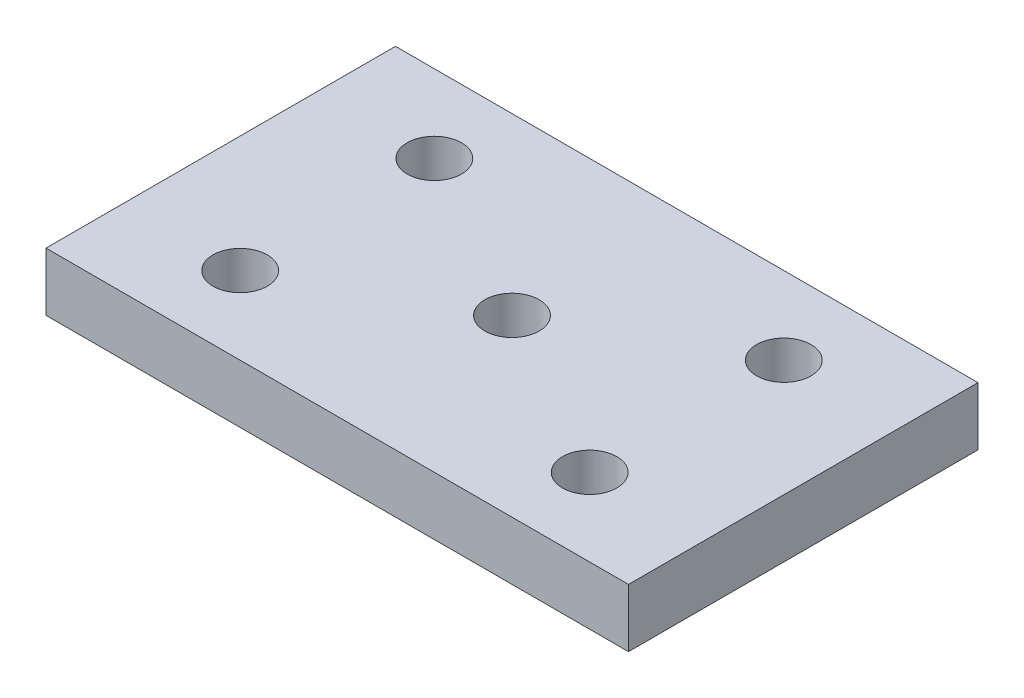
ISO-10303-21;
HEADER;
FILE_DESCRIPTION(('STEP AP214'),'2;1');
FILE_NAME('part.step','',(''),(''),'','','');
FILE_SCHEMA(('AUTOMOTIVE_DESIGN { 1 0 10303 214 1 1 1 1 }'));
ENDSEC;
DATA;
#1=APPLICATION_CONTEXT('core data for automotive mechanical design processes');
#2=APPLICATION_PROTOCOL_DEFINITION('international standard','automotive_design',2000,#1);
#3=PRODUCT_CONTEXT('',#1,'mechanical');
#4=PRODUCT('Part','Part','',(#3));
#5=PRODUCT_RELATED_PRODUCT_CATEGORY('part','',(#4));
#6=PRODUCT_DEFINITION_FORMATION('','',#4);
#7=PRODUCT_DEFINITION_CONTEXT('part definition',#1,'design');
#8=PRODUCT_DEFINITION('design','',#6,#7);
#9=PRODUCT_DEFINITION_SHAPE('','',#8);
#10=(LENGTH_UNIT() NAMED_UNIT(*) SI_UNIT(.MILLI.,.METRE.));
#11=(NAMED_UNIT(*) PLANE_ANGLE_UNIT() SI_UNIT($,.RADIAN.));
#12=(NAMED_UNIT(*) SI_UNIT($,.STERADIAN.) SOLID_ANGLE_UNIT());
#13=UNCERTAINTY_MEASURE_WITH_UNIT(LENGTH_MEASURE(1.E-05),#10,'distance_accuracy_value','');
#14=(GEOMETRIC_REPRESENTATION_CONTEXT(3) GLOBAL_UNCERTAINTY_ASSIGNED_CONTEXT((#13)) GLOBAL_UNIT_ASSIGNED_CONTEXT((#10,
#11,#12)) REPRESENTATION_CONTEXT('',''));
#15=CARTESIAN_POINT('',(0.,0.,0.));
#16=DIRECTION('',(0.,0.,1.));
#17=DIRECTION('',(1.,0.,0.));
#18=AXIS2_PLACEMENT_3D('',#15,#16,#17);
#19=CARTESIAN_POINT('',(0.,3.,0.));
#20=DIRECTION('',(0.,-1.,0.));
#21=DIRECTION('',(0.,0.,-1.));
#22=AXIS2_PLACEMENT_3D('',#19,#20,#21);
#23=PLANE('',#22);
#24=DIRECTION('',(0.,0.,1.));
#25=VECTOR('',#24,1.);
#26=CARTESIAN_POINT('',(0.,3.,0.));
#27=LINE('',#26,#25);
#28=CARTESIAN_POINT('',(0.,3.,-18.));
#29=VERTEX_POINT('',#28);
#30=CARTESIAN_POINT('',(0.,3.,0.));
#31=VERTEX_POINT('',#30);
#32=EDGE_CURVE('E85',#29,#31,#27,.T.);
#33=ORIENTED_EDGE('',*,*,#32,.T.);
#34=DIRECTION('',(1.,0.,0.));
#35=VECTOR('',#34,1.);
#36=CARTESIAN_POINT('',(0.,3.,0.));
#37=LINE('',#36,#35);
#38=CARTESIAN_POINT('',(30.,3.,0.));
#39=VERTEX_POINT('',#38);
#40=EDGE_CURVE('E80',#31,#39,#37,.T.);
#41=ORIENTED_EDGE('',*,*,#40,.T.);
#42=DIRECTION('',(0.,0.,-1.));
#43=VECTOR('',#42,1.);
#44=CARTESIAN_POINT('',(30.,3.,0.));
#45=LINE('',#44,#43);
#46=CARTESIAN_POINT('',(30.,3.,-18.));
#47=VERTEX_POINT('',#46);
#48=EDGE_CURVE('E83',#39,#47,#45,.T.);
#49=ORIENTED_EDGE('',*,*,#48,.T.);
#50=DIRECTION('',(-1.,0.,0.));
#51=VECTOR('',#50,1.);
#52=CARTESIAN_POINT('',(0.,3.,-18.));
#53=LINE('',#52,#51);
#54=EDGE_CURVE('E50',#47,#29,#53,.T.);
#55=ORIENTED_EDGE('',*,*,#54,.T.);
#56=EDGE_LOOP('',(#33,#41,#49,#55));
#57=FACE_BOUND('',#56,.T.);
#58=CARTESIAN_POINT('',(6.,3.,-4.));
#59=DIRECTION('',(0.,1.,0.));
#60=DIRECTION('',(0.,0.,1.));
#61=AXIS2_PLACEMENT_3D('',#58,#59,#60);
#62=CIRCLE('',#61,1.4);
#63=CARTESIAN_POINT('',(6.,3.,-2.6));
#64=VERTEX_POINT('',#63);
#65=EDGE_CURVE('E100',#64,#64,#62,.T.);
#66=ORIENTED_EDGE('',*,*,#65,.F.);
#67=EDGE_LOOP('',(#66));
#68=FACE_BOUND('',#67,.T.);
#69=CARTESIAN_POINT('',(24.,3.,-4.));
#70=DIRECTION('',(0.,1.,0.));
#71=DIRECTION('',(0.,0.,1.));
#72=AXIS2_PLACEMENT_3D('',#69,#70,#71);
#73=CIRCLE('',#72,1.4);
#74=CARTESIAN_POINT('',(24.,3.,-2.6));
#75=VERTEX_POINT('',#74);
#76=EDGE_CURVE('E115',#75,#75,#73,.T.);
#77=ORIENTED_EDGE('',*,*,#76,.F.);
#78=EDGE_LOOP('',(#77));
#79=FACE_BOUND('',#78,.T.);
#80=CARTESIAN_POINT('',(24.,3.,-14.));
#81=DIRECTION('',(0.,1.,0.));
#82=DIRECTION('',(0.,0.,1.));
#83=AXIS2_PLACEMENT_3D('',#80,#81,#82);
#84=CIRCLE('',#83,1.4);
#85=CARTESIAN_POINT('',(24.,3.,-12.6));
#86=VERTEX_POINT('',#85);
#87=EDGE_CURVE('E121',#86,#86,#84,.T.);
#88=ORIENTED_EDGE('',*,*,#87,.F.);
#89=EDGE_LOOP('',(#88));
#90=FACE_BOUND('',#89,.T.);
#91=CARTESIAN_POINT('',(6.,3.,-14.));
#92=DIRECTION('',(0.,1.,0.));
#93=DIRECTION('',(0.,0.,1.));
#94=AXIS2_PLACEMENT_3D('',#91,#92,#93);
#95=CIRCLE('',#94,1.4);
#96=CARTESIAN_POINT('',(6.,3.,-12.6));
#97=VERTEX_POINT('',#96);
#98=EDGE_CURVE('E127',#97,#97,#95,.T.);
#99=ORIENTED_EDGE('',*,*,#98,.F.);
#100=EDGE_LOOP('',(#99));
#101=FACE_BOUND('',#100,.T.);
#102=CARTESIAN_POINT('',(15.,3.,-9.));
#103=DIRECTION('',(0.,1.,0.));
#104=DIRECTION('',(0.,0.,1.));
#105=AXIS2_PLACEMENT_3D('',#102,#103,#104);
#106=CIRCLE('',#105,1.4);
#107=CARTESIAN_POINT('',(15.,3.,-7.6));
#108=VERTEX_POINT('',#107);
#109=EDGE_CURVE('E133',#108,#108,#106,.T.);
#110=ORIENTED_EDGE('',*,*,#109,.F.);
#111=EDGE_LOOP('',(#110));
#112=FACE_BOUND('',#111,.T.);
#113=ADVANCED_FACE('F33',(#57,#68,#79,#90,#101,#112),#23,.F.);
#114=CARTESIAN_POINT('',(0.,0.,0.));
#115=DIRECTION('',(0.,-1.,0.));
#116=DIRECTION('',(0.,0.,-1.));
#117=AXIS2_PLACEMENT_3D('',#114,#115,#116);
#118=PLANE('',#117);
#119=CARTESIAN_POINT('',(6.,0.,-14.));
#120=DIRECTION('',(0.,1.,0.));
#121=DIRECTION('',(0.,0.,1.));
#122=AXIS2_PLACEMENT_3D('',#119,#120,#121);
#123=CIRCLE('',#122,1.4);
#124=CARTESIAN_POINT('',(6.,0.,-12.6));
#125=VERTEX_POINT('',#124);
#126=EDGE_CURVE('E130',#125,#125,#123,.T.);
#127=ORIENTED_EDGE('',*,*,#126,.T.);
#128=EDGE_LOOP('',(#127));
#129=FACE_BOUND('',#128,.T.);
#130=CARTESIAN_POINT('',(24.,0.,-4.));
#131=DIRECTION('',(0.,1.,0.));
#132=DIRECTION('',(0.,0.,1.));
#133=AXIS2_PLACEMENT_3D('',#130,#131,#132);
#134=CIRCLE('',#133,1.4);
#135=CARTESIAN_POINT('',(24.,0.,-2.6));
#136=VERTEX_POINT('',#135);
#137=EDGE_CURVE('E118',#136,#136,#134,.T.);
#138=ORIENTED_EDGE('',*,*,#137,.T.);
#139=EDGE_LOOP('',(#138));
#140=FACE_BOUND('',#139,.T.);
#141=DIRECTION('',(0.,0.,1.));
#142=VECTOR('',#141,1.);
#143=CARTESIAN_POINT('',(0.,0.,0.));
#144=LINE('',#143,#142);
#145=CARTESIAN_POINT('',(0.,0.,-18.));
#146=VERTEX_POINT('',#145);
#147=CARTESIAN_POINT('',(0.,0.,0.));
#148=VERTEX_POINT('',#147);
#149=EDGE_CURVE('E97',#146,#148,#144,.T.);
#150=ORIENTED_EDGE('',*,*,#149,.F.);
#151=DIRECTION('',(-1.,0.,0.));
#152=VECTOR('',#151,1.);
#153=CARTESIAN_POINT('',(0.,0.,-18.));
#154=LINE('',#153,#152);
#155=CARTESIAN_POINT('',(30.,0.,-18.));
#156=VERTEX_POINT('',#155);
#157=EDGE_CURVE('E73',#156,#146,#154,.T.);
#158=ORIENTED_EDGE('',*,*,#157,.F.);
#159=DIRECTION('',(0.,0.,-1.));
#160=VECTOR('',#159,1.);
#161=CARTESIAN_POINT('',(30.,0.,0.));
#162=LINE('',#161,#160);
#163=CARTESIAN_POINT('',(30.,0.,0.));
#164=VERTEX_POINT('',#163);
#165=EDGE_CURVE('E67',#164,#156,#162,.T.);
#166=ORIENTED_EDGE('',*,*,#165,.F.);
#167=DIRECTION('',(1.,0.,0.));
#168=VECTOR('',#167,1.);
#169=CARTESIAN_POINT('',(0.,0.,0.));
#170=LINE('',#169,#168);
#171=EDGE_CURVE('E89',#148,#164,#170,.T.);
#172=ORIENTED_EDGE('',*,*,#171,.F.);
#173=EDGE_LOOP('',(#150,#158,#166,#172));
#174=FACE_BOUND('',#173,.T.);
#175=CARTESIAN_POINT('',(6.,0.,-4.));
#176=DIRECTION('',(0.,1.,0.));
#177=DIRECTION('',(0.,0.,1.));
#178=AXIS2_PLACEMENT_3D('',#175,#176,#177);
#179=CIRCLE('',#178,1.4);
#180=CARTESIAN_POINT('',(6.,0.,-2.6));
#181=VERTEX_POINT('',#180);
#182=EDGE_CURVE('E112',#181,#181,#179,.T.);
#183=ORIENTED_EDGE('',*,*,#182,.T.);
#184=EDGE_LOOP('',(#183));
#185=FACE_BOUND('',#184,.T.);
#186=CARTESIAN_POINT('',(24.,0.,-14.));
#187=DIRECTION('',(0.,1.,0.));
#188=DIRECTION('',(0.,0.,1.));
#189=AXIS2_PLACEMENT_3D('',#186,#187,#188);
#190=CIRCLE('',#189,1.4);
#191=CARTESIAN_POINT('',(24.,0.,-12.6));
#192=VERTEX_POINT('',#191);
#193=EDGE_CURVE('E124',#192,#192,#190,.T.);
#194=ORIENTED_EDGE('',*,*,#193,.T.);
#195=EDGE_LOOP('',(#194));
#196=FACE_BOUND('',#195,.T.);
#197=CARTESIAN_POINT('',(15.,0.,-9.));
#198=DIRECTION('',(0.,1.,0.));
#199=DIRECTION('',(0.,0.,1.));
#200=AXIS2_PLACEMENT_3D('',#197,#198,#199);
#201=CIRCLE('',#200,1.4);
#202=CARTESIAN_POINT('',(15.,0.,-7.6));
#203=VERTEX_POINT('',#202);
#204=EDGE_CURVE('E136',#203,#203,#201,.T.);
#205=ORIENTED_EDGE('',*,*,#204,.T.);
#206=EDGE_LOOP('',(#205));
#207=FACE_BOUND('',#206,.T.);
#208=ADVANCED_FACE('F108',(#129,#140,#174,#185,#196,#207),#118,.T.);
#209=CARTESIAN_POINT('',(0.,3.,0.));
#210=DIRECTION('',(1.,0.,0.));
#211=DIRECTION('',(0.,0.,-1.));
#212=AXIS2_PLACEMENT_3D('',#209,#210,#211);
#213=PLANE('',#212);
#214=ORIENTED_EDGE('',*,*,#149,.T.);
#215=DIRECTION('',(0.,-1.,0.));
#216=VECTOR('',#215,1.);
#217=CARTESIAN_POINT('',(0.,3.,0.));
#218=LINE('',#217,#216);
#219=EDGE_CURVE('E11',#31,#148,#218,.T.);
#220=ORIENTED_EDGE('',*,*,#219,.F.);
#221=ORIENTED_EDGE('',*,*,#32,.F.);
#222=DIRECTION('',(0.,-1.,0.));
#223=VECTOR('',#222,1.);
#224=CARTESIAN_POINT('',(0.,3.,-18.));
#225=LINE('',#224,#223);
#226=EDGE_CURVE('E93',#29,#146,#225,.T.);
#227=ORIENTED_EDGE('',*,*,#226,.T.);
#228=EDGE_LOOP('',(#214,#220,#221,#227));
#229=FACE_BOUND('',#228,.T.);
#230=ADVANCED_FACE('F35',(#229),#213,.F.);
#231=CARTESIAN_POINT('',(0.,3.,0.));
#232=DIRECTION('',(0.,0.,-1.));
#233=DIRECTION('',(-1.,0.,0.));
#234=AXIS2_PLACEMENT_3D('',#231,#232,#233);
#235=PLANE('',#234);
#236=ORIENTED_EDGE('',*,*,#171,.T.);
#237=DIRECTION('',(0.,-1.,0.));
#238=VECTOR('',#237,1.);
#239=CARTESIAN_POINT('',(30.,3.,0.));
#240=LINE('',#239,#238);
#241=EDGE_CURVE('E42',#39,#164,#240,.T.);
#242=ORIENTED_EDGE('',*,*,#241,.F.);
#243=ORIENTED_EDGE('',*,*,#40,.F.);
#244=ORIENTED_EDGE('',*,*,#219,.T.);
#245=EDGE_LOOP('',(#236,#242,#243,#244));
#246=FACE_BOUND('',#245,.T.);
#247=ADVANCED_FACE('F88',(#246),#235,.F.);
#248=CARTESIAN_POINT('',(30.,3.,0.));
#249=DIRECTION('',(-1.,0.,0.));
#250=DIRECTION('',(0.,0.,1.));
#251=AXIS2_PLACEMENT_3D('',#248,#249,#250);
#252=PLANE('',#251);
#253=ORIENTED_EDGE('',*,*,#165,.T.);
#254=DIRECTION('',(0.,-1.,0.));
#255=VECTOR('',#254,1.);
#256=CARTESIAN_POINT('',(30.,3.,-18.));
#257=LINE('',#256,#255);
#258=EDGE_CURVE('E90',#47,#156,#257,.T.);
#259=ORIENTED_EDGE('',*,*,#258,.F.);
#260=ORIENTED_EDGE('',*,*,#48,.F.);
#261=ORIENTED_EDGE('',*,*,#241,.T.);
#262=EDGE_LOOP('',(#253,#259,#260,#261));
#263=FACE_BOUND('',#262,.T.);
#264=ADVANCED_FACE('F91',(#263),#252,.F.);
#265=CARTESIAN_POINT('',(0.,3.,-18.));
#266=DIRECTION('',(0.,0.,1.));
#267=DIRECTION('',(1.,0.,0.));
#268=AXIS2_PLACEMENT_3D('',#265,#266,#267);
#269=PLANE('',#268);
#270=ORIENTED_EDGE('',*,*,#157,.T.);
#271=ORIENTED_EDGE('',*,*,#226,.F.);
#272=ORIENTED_EDGE('',*,*,#54,.F.);
#273=ORIENTED_EDGE('',*,*,#258,.T.);
#274=EDGE_LOOP('',(#270,#271,#272,#273));
#275=FACE_BOUND('',#274,.T.);
#276=ADVANCED_FACE('F105',(#275),#269,.F.);
#277=CARTESIAN_POINT('',(6.,3.,-4.));
#278=DIRECTION('',(0.,-1.,0.));
#279=DIRECTION('',(0.,0.,-1.));
#280=AXIS2_PLACEMENT_3D('',#277,#278,#279);
#281=CYLINDRICAL_SURFACE('',#280,1.4);
#282=ORIENTED_EDGE('',*,*,#65,.T.);
#283=EDGE_LOOP('',(#282));
#284=FACE_BOUND('',#283,.T.);
#285=ORIENTED_EDGE('',*,*,#182,.F.);
#286=EDGE_LOOP('',(#285));
#287=FACE_BOUND('',#286,.T.);
#288=ADVANCED_FACE('F153',(#284,#287),#281,.F.);
#289=CARTESIAN_POINT('',(24.,3.,-4.));
#290=DIRECTION('',(0.,-1.,0.));
#291=DIRECTION('',(0.,0.,-1.));
#292=AXIS2_PLACEMENT_3D('',#289,#290,#291);
#293=CYLINDRICAL_SURFACE('',#292,1.4);
#294=ORIENTED_EDGE('',*,*,#76,.T.);
#295=EDGE_LOOP('',(#294));
#296=FACE_BOUND('',#295,.T.);
#297=ORIENTED_EDGE('',*,*,#137,.F.);
#298=EDGE_LOOP('',(#297));
#299=FACE_BOUND('',#298,.T.);
#300=ADVANCED_FACE('F199',(#296,#299),#293,.F.);
#301=CARTESIAN_POINT('',(24.,3.,-14.));
#302=DIRECTION('',(0.,-1.,0.));
#303=DIRECTION('',(0.,0.,-1.));
#304=AXIS2_PLACEMENT_3D('',#301,#302,#303);
#305=CYLINDRICAL_SURFACE('',#304,1.4);
#306=ORIENTED_EDGE('',*,*,#87,.T.);
#307=EDGE_LOOP('',(#306));
#308=FACE_BOUND('',#307,.T.);
#309=ORIENTED_EDGE('',*,*,#193,.F.);
#310=EDGE_LOOP('',(#309));
#311=FACE_BOUND('',#310,.T.);
#312=ADVANCED_FACE('F207',(#308,#311),#305,.F.);
#313=CARTESIAN_POINT('',(6.,3.,-14.));
#314=DIRECTION('',(0.,-1.,0.));
#315=DIRECTION('',(0.,0.,-1.));
#316=AXIS2_PLACEMENT_3D('',#313,#314,#315);
#317=CYLINDRICAL_SURFACE('',#316,1.4);
#318=ORIENTED_EDGE('',*,*,#98,.T.);
#319=EDGE_LOOP('',(#318));
#320=FACE_BOUND('',#319,.T.);
#321=ORIENTED_EDGE('',*,*,#126,.F.);
#322=EDGE_LOOP('',(#321));
#323=FACE_BOUND('',#322,.T.);
#324=ADVANCED_FACE('F215',(#320,#323),#317,.F.);
#325=CARTESIAN_POINT('',(15.,3.,-9.));
#326=DIRECTION('',(0.,-1.,0.));
#327=DIRECTION('',(0.,0.,-1.));
#328=AXIS2_PLACEMENT_3D('',#325,#326,#327);
#329=CYLINDRICAL_SURFACE('',#328,1.4);
#330=ORIENTED_EDGE('',*,*,#109,.T.);
#331=EDGE_LOOP('',(#330));
#332=FACE_BOUND('',#331,.T.);
#333=ORIENTED_EDGE('',*,*,#204,.F.);
#334=EDGE_LOOP('',(#333));
#335=FACE_BOUND('',#334,.T.);
#336=ADVANCED_FACE('F142',(#332,#335),#329,.F.);
#337=CLOSED_SHELL('',(#113,#208,#230,#247,#264,#276,#288,#300,#312,#324,#336));
#338=MANIFOLD_SOLID_BREP('B2',#337);
#339=ADVANCED_BREP_SHAPE_REPRESENTATION('',(#18,#338),#14);
#340=SHAPE_DEFINITION_REPRESENTATION(#9,#339);
ENDSEC;
END-ISO-10303-21;
